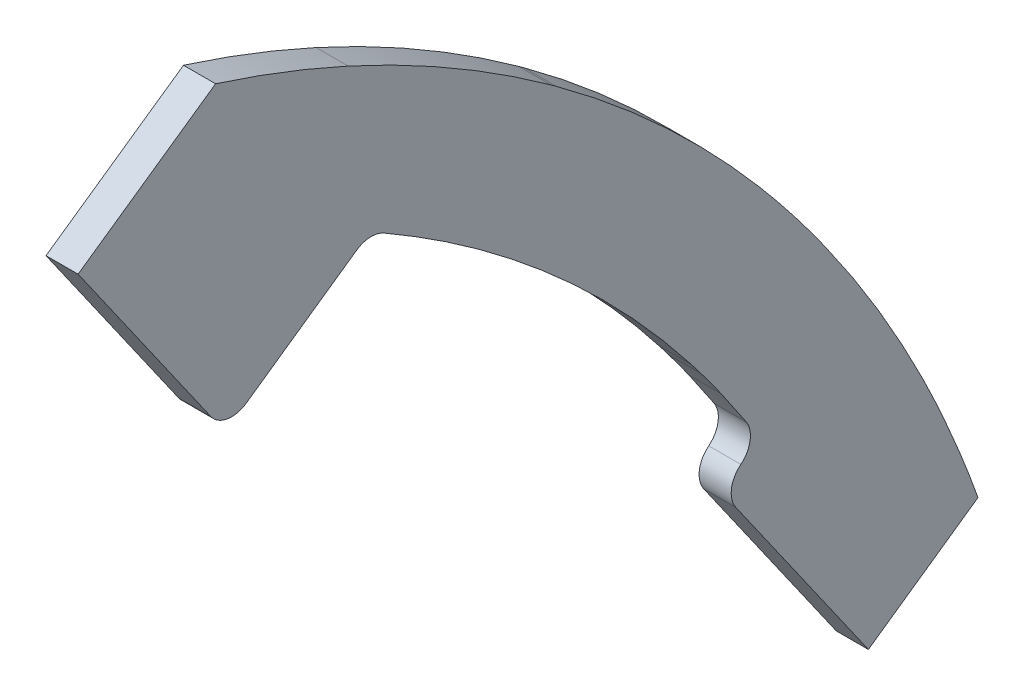
ISO-10303-21;
HEADER;
FILE_DESCRIPTION(('STEP AP214'),'2;1');
FILE_NAME('part.step','',(''),(''),'','','');
FILE_SCHEMA(('AUTOMOTIVE_DESIGN { 1 0 10303 214 1 1 1 1 }'));
ENDSEC;
DATA;
#1=APPLICATION_CONTEXT('core data for automotive mechanical design processes');
#2=APPLICATION_PROTOCOL_DEFINITION('international standard','automotive_design',2000,#1);
#3=PRODUCT_CONTEXT('',#1,'mechanical');
#4=PRODUCT('Part','Part','',(#3));
#5=PRODUCT_RELATED_PRODUCT_CATEGORY('part','',(#4));
#6=PRODUCT_DEFINITION_FORMATION('','',#4);
#7=PRODUCT_DEFINITION_CONTEXT('part definition',#1,'design');
#8=PRODUCT_DEFINITION('design','',#6,#7);
#9=PRODUCT_DEFINITION_SHAPE('','',#8);
#10=(LENGTH_UNIT() NAMED_UNIT(*) SI_UNIT(.MILLI.,.METRE.));
#11=(NAMED_UNIT(*) PLANE_ANGLE_UNIT() SI_UNIT($,.RADIAN.));
#12=(NAMED_UNIT(*) SI_UNIT($,.STERADIAN.) SOLID_ANGLE_UNIT());
#13=UNCERTAINTY_MEASURE_WITH_UNIT(LENGTH_MEASURE(1.E-05),#10,'distance_accuracy_value','');
#14=(GEOMETRIC_REPRESENTATION_CONTEXT(3) GLOBAL_UNCERTAINTY_ASSIGNED_CONTEXT((#13)) GLOBAL_UNIT_ASSIGNED_CONTEXT((#10,
#11,#12)) REPRESENTATION_CONTEXT('',''));
#15=CARTESIAN_POINT('',(0.,0.,0.));
#16=DIRECTION('',(0.,0.,1.));
#17=DIRECTION('',(1.,0.,0.));
#18=AXIS2_PLACEMENT_3D('',#15,#16,#17);
#19=CARTESIAN_POINT('',(-1.5875,79.185436309453,-95.7912382765299));
#20=CARTESIAN_POINT('',(-1.5875,85.5615552261648,-92.9425869088173));
#21=CARTESIAN_POINT('',(-1.5875,91.6478017593914,-89.4641241758632));
#22=CARTESIAN_POINT('',(-1.5875,97.3383774812052,-85.4160257219503));
#23=B_SPLINE_CURVE_WITH_KNOTS('',3,(#19,#20,#21,#22),.UNSPECIFIED.,.F.,.F.,(4,4),(0.,1.),.UNSPECIFIED.);
#24=DIRECTION('',(1.,0.,0.));
#25=VECTOR('',#24,1.);
#26=SURFACE_OF_LINEAR_EXTRUSION('',#23,#25);
#27=CARTESIAN_POINT('',(-1.5875,97.3383774812052,-85.4160257219503));
#28=CARTESIAN_POINT('',(-1.5875,96.1185054495558,-86.2838047177313));
#29=CARTESIAN_POINT('',(-1.5875,94.8804510622425,-87.1254071066499));
#30=CARTESIAN_POINT('',(-1.5875,93.6252565249009,-87.9402401067826));
#31=B_SPLINE_CURVE_WITH_KNOTS('',3,(#27,#28,#29,#30),.UNSPECIFIED.,.F.,.F.,(4,4),
(0.785632932187644,1.),.UNSPECIFIED.);
#32=CARTESIAN_POINT('',(-1.5875,93.625282671798,-87.9402803842903));
#33=VERTEX_POINT('',#32);
#34=CARTESIAN_POINT('',(-1.5875,97.3383774204889,-85.416025636599));
#35=VERTEX_POINT('',#34);
#36=EDGE_CURVE('E383',#33,#35,#31,.F.);
#37=ORIENTED_EDGE('',*,*,#36,.F.);
#38=DIRECTION('',(1.,0.,0.));
#39=VECTOR('',#38,1.);
#40=CARTESIAN_POINT('',(-1.5875,93.6252565239648,-87.9402401073903));
#41=LINE('',#40,#39);
#42=CARTESIAN_POINT('',(1.5875,93.625282671798,-87.9402803842903));
#43=VERTEX_POINT('',#42);
#44=EDGE_CURVE('E64',#33,#43,#41,.T.);
#45=ORIENTED_EDGE('',*,*,#44,.T.);
#46=CARTESIAN_POINT('',(1.5875,93.6252565244328,-87.9402401070865));
#47=CARTESIAN_POINT('',(1.5875,94.8804510619347,-87.1254071068591));
#48=CARTESIAN_POINT('',(1.5875,96.1185054494041,-86.2838047178392));
#49=CARTESIAN_POINT('',(1.5875,97.3383774812052,-85.4160257219503));
#50=B_SPLINE_CURVE_WITH_KNOTS('',3,(#46,#47,#48,#49),.UNSPECIFIED.,.F.,.F.,(4,4),
(0.785632932160998,1.),.UNSPECIFIED.);
#51=CARTESIAN_POINT('',(1.5875,97.3383774204889,-85.416025636599));
#52=VERTEX_POINT('',#51);
#53=EDGE_CURVE('E287',#43,#52,#50,.T.);
#54=ORIENTED_EDGE('',*,*,#53,.T.);
#55=DIRECTION('',(1.,0.,0.));
#56=VECTOR('',#55,1.);
#57=CARTESIAN_POINT('',(-1.5875,97.3383774204889,-85.416025636599));
#58=LINE('',#57,#56);
#59=EDGE_CURVE('E374',#35,#52,#58,.T.);
#60=ORIENTED_EDGE('',*,*,#59,.F.);
#61=EDGE_LOOP('',(#37,#45,#54,#60));
#62=FACE_BOUND('',#61,.T.);
#63=ADVANCED_FACE('F41',(#62),#26,.F.);
#64=CARTESIAN_POINT('',(1.5875,84.3658917657913,-107.386620170409));
#65=CARTESIAN_POINT('',(1.5875,79.0286884505717,-109.77111636803));
#66=CARTESIAN_POINT('',(1.5875,73.5144507800528,-111.759937992686));
#67=CARTESIAN_POINT('',(1.5875,67.8835058486477,-113.331446437734));
#68=(BOUNDED_CURVE() B_SPLINE_CURVE(3,(#64,#65,#66,#67),.UNSPECIFIED.,.F.,
.F.) B_SPLINE_CURVE_WITH_KNOTS((4,4),(0.,1.),
.UNSPECIFIED.) CURVE() GEOMETRIC_REPRESENTATION_ITEM() RATIONAL_B_SPLINE_CURVE((1.,1.,1.,1.)) REPRESENTATION_ITEM(''));
#69=DIRECTION('',(-1.,0.,0.));
#70=VECTOR('',#69,1.);
#71=SURFACE_OF_LINEAR_EXTRUSION('',#68,#70);
#72=DIRECTION('',(1.,0.,0.));
#73=VECTOR('',#72,1.);
#74=CARTESIAN_POINT('',(-2.2225,75.6870130191699,-110.85997856764));
#75=LINE('',#74,#73);
#76=CARTESIAN_POINT('',(-1.5875,75.6870130191699,-110.85997856764));
#77=VERTEX_POINT('',#76);
#78=CARTESIAN_POINT('',(1.5875,75.6870130191699,-110.85997856764));
#79=VERTEX_POINT('',#78);
#80=EDGE_CURVE('E201',#77,#79,#75,.T.);
#81=ORIENTED_EDGE('',*,*,#80,.F.);
#82=CARTESIAN_POINT('',(-1.5875,84.3658917657913,-107.386620170409));
#83=CARTESIAN_POINT('',(-1.5875,79.0286884505717,-109.77111636803));
#84=CARTESIAN_POINT('',(-1.5875,73.5144507800528,-111.759937992686));
#85=CARTESIAN_POINT('',(-1.5875,67.8835058486477,-113.331446437734));
#86=(BOUNDED_CURVE() B_SPLINE_CURVE(3,(#82,#83,#84,#85),.UNSPECIFIED.,.F.,
.F.) B_SPLINE_CURVE_WITH_KNOTS((4,4),(0.,1.),
.UNSPECIFIED.) CURVE() GEOMETRIC_REPRESENTATION_ITEM() RATIONAL_B_SPLINE_CURVE((1.,1.,1.,1.)) REPRESENTATION_ITEM(''));
#87=CARTESIAN_POINT('',(-1.5875,84.3658917657913,-107.386620170409));
#88=VERTEX_POINT('',#87);
#89=EDGE_CURVE('E478',#88,#77,#86,.T.);
#90=ORIENTED_EDGE('',*,*,#89,.F.);
#91=DIRECTION('',(-1.,0.,0.));
#92=VECTOR('',#91,1.);
#93=CARTESIAN_POINT('',(1.5875,84.3658917657913,-107.386620170409));
#94=LINE('',#93,#92);
#95=CARTESIAN_POINT('',(1.5875,84.3658917657913,-107.386620170409));
#96=VERTEX_POINT('',#95);
#97=EDGE_CURVE('E220',#96,#88,#94,.T.);
#98=ORIENTED_EDGE('',*,*,#97,.F.);
#99=EDGE_CURVE('E448',#96,#79,#68,.T.);
#100=ORIENTED_EDGE('',*,*,#99,.T.);
#101=EDGE_LOOP('',(#81,#90,#98,#100));
#102=FACE_BOUND('',#101,.T.);
#103=ADVANCED_FACE('F310',(#102),#71,.T.);
#104=CARTESIAN_POINT('',(1.5875,104.700101100998,-95.7646983588532));
#105=CARTESIAN_POINT('',(1.5875,98.3283858568585,-100.29733826903));
#106=CARTESIAN_POINT('',(1.5875,91.5059052747289,-104.196684492764));
#107=CARTESIAN_POINT('',(1.5875,84.3658917657913,-107.386620170409));
#108=(BOUNDED_CURVE() B_SPLINE_CURVE(3,(#104,#105,#106,#107),.UNSPECIFIED.,.F.,
.F.) B_SPLINE_CURVE_WITH_KNOTS((4,4),(0.000350040646092085,1.),
.UNSPECIFIED.) CURVE() GEOMETRIC_REPRESENTATION_ITEM() RATIONAL_B_SPLINE_CURVE((1.,1.,1.,1.)) REPRESENTATION_ITEM(''));
#109=DIRECTION('',(-1.,0.,0.));
#110=VECTOR('',#109,1.);
#111=SURFACE_OF_LINEAR_EXTRUSION('',#108,#110);
#112=CARTESIAN_POINT('',(-1.5875,104.700101100998,-95.7646983588532));
#113=CARTESIAN_POINT('',(-1.5875,98.3283858568585,-100.29733826903));
#114=CARTESIAN_POINT('',(-1.5875,91.5059052747289,-104.196684492764));
#115=CARTESIAN_POINT('',(-1.5875,84.3658917657913,-107.386620170409));
#116=(BOUNDED_CURVE() B_SPLINE_CURVE(3,(#112,#113,#114,#115),.UNSPECIFIED.,.F.,
.F.) B_SPLINE_CURVE_WITH_KNOTS((4,4),(0.000350040646092085,1.),
.UNSPECIFIED.) CURVE() GEOMETRIC_REPRESENTATION_ITEM() RATIONAL_B_SPLINE_CURVE((1.,1.,1.,1.)) REPRESENTATION_ITEM(''));
#117=CARTESIAN_POINT('',(-1.5875,104.700100970802,-95.7646981758488));
#118=VERTEX_POINT('',#117);
#119=EDGE_CURVE('E474',#118,#88,#116,.T.);
#120=ORIENTED_EDGE('',*,*,#119,.F.);
#121=DIRECTION('',(-1.,0.,0.));
#122=VECTOR('',#121,1.);
#123=CARTESIAN_POINT('',(1.5875,104.700100970802,-95.7646981758488));
#124=LINE('',#123,#122);
#125=CARTESIAN_POINT('',(1.5875,104.700100970802,-95.7646981758488));
#126=VERTEX_POINT('',#125);
#127=EDGE_CURVE('E402',#126,#118,#124,.T.);
#128=ORIENTED_EDGE('',*,*,#127,.F.);
#129=EDGE_CURVE('E444',#126,#96,#108,.T.);
#130=ORIENTED_EDGE('',*,*,#129,.T.);
#131=ORIENTED_EDGE('',*,*,#97,.T.);
#132=EDGE_LOOP('',(#120,#128,#130,#131));
#133=FACE_BOUND('',#132,.T.);
#134=ADVANCED_FACE('F602',(#133),#111,.T.);
#135=CARTESIAN_POINT('',(1.5875,24.4998519396042,16.9760355825652));
#136=DIRECTION('',(-1.,0.,0.));
#137=DIRECTION('',(0.,0.,1.));
#138=AXIS2_PLACEMENT_3D('',#135,#136,#137);
#139=CYLINDRICAL_SURFACE('',#138,138.356615284748);
#140=CARTESIAN_POINT('',(-1.5875,24.4998519396042,16.9760355825652));
#141=DIRECTION('',(1.,0.,0.));
#142=DIRECTION('',(0.,0.,-1.));
#143=AXIS2_PLACEMENT_3D('',#140,#141,#142);
#144=CIRCLE('',#143,138.356615284748);
#145=CARTESIAN_POINT('',(-1.5875,107.663329549967,-93.5969673829078));
#146=VERTEX_POINT('',#145);
#147=EDGE_CURVE('E470',#146,#118,#144,.F.);
#148=ORIENTED_EDGE('',*,*,#147,.F.);
#149=DIRECTION('',(-1.,0.,0.));
#150=VECTOR('',#149,1.);
#151=CARTESIAN_POINT('',(1.5875,107.663329549967,-93.5969673829078));
#152=LINE('',#151,#150);
#153=CARTESIAN_POINT('',(1.5875,107.663329549967,-93.5969673829078));
#154=VERTEX_POINT('',#153);
#155=EDGE_CURVE('E405',#154,#146,#152,.T.);
#156=ORIENTED_EDGE('',*,*,#155,.F.);
#157=CARTESIAN_POINT('',(1.5875,24.4998519396042,16.9760355825652));
#158=DIRECTION('',(1.,0.,0.));
#159=DIRECTION('',(0.,0.,-1.));
#160=AXIS2_PLACEMENT_3D('',#157,#158,#159);
#161=CIRCLE('',#160,138.356615284748);
#162=EDGE_CURVE('E440',#154,#126,#161,.F.);
#163=ORIENTED_EDGE('',*,*,#162,.T.);
#164=ORIENTED_EDGE('',*,*,#127,.T.);
#165=EDGE_LOOP('',(#148,#156,#163,#164));
#166=FACE_BOUND('',#165,.T.);
#167=ADVANCED_FACE('F605',(#166),#139,.T.);
#168=CARTESIAN_POINT('',(1.5875,37.7943846700121,-0.700190199036881));
#169=DIRECTION('',(-1.,0.,0.));
#170=DIRECTION('',(0.,0.,1.));
#171=AXIS2_PLACEMENT_3D('',#168,#169,#170);
#172=CYLINDRICAL_SURFACE('',#171,116.238894853704);
#173=CARTESIAN_POINT('',(-1.5875,37.7943846700121,-0.700190199036881));
#174=DIRECTION('',(1.,0.,0.));
#175=DIRECTION('',(0.,0.,-1.));
#176=AXIS2_PLACEMENT_3D('',#173,#174,#175);
#177=CIRCLE('',#176,116.238894853704);
#178=CARTESIAN_POINT('',(-1.5875,109.04382947504,-92.542431525051));
#179=VERTEX_POINT('',#178);
#180=EDGE_CURVE('E466',#179,#146,#177,.F.);
#181=ORIENTED_EDGE('',*,*,#180,.F.);
#182=DIRECTION('',(-1.,0.,0.));
#183=VECTOR('',#182,1.);
#184=CARTESIAN_POINT('',(1.5875,109.04382947504,-92.542431525051));
#185=LINE('',#184,#183);
#186=CARTESIAN_POINT('',(1.5875,109.04382947504,-92.542431525051));
#187=VERTEX_POINT('',#186);
#188=EDGE_CURVE('E408',#187,#179,#185,.T.);
#189=ORIENTED_EDGE('',*,*,#188,.F.);
#190=CARTESIAN_POINT('',(1.5875,37.7943846700121,-0.700190199036881));
#191=DIRECTION('',(1.,0.,0.));
#192=DIRECTION('',(0.,0.,-1.));
#193=AXIS2_PLACEMENT_3D('',#190,#191,#192);
#194=CIRCLE('',#193,116.238894853704);
#195=EDGE_CURVE('E436',#187,#154,#194,.F.);
#196=ORIENTED_EDGE('',*,*,#195,.T.);
#197=ORIENTED_EDGE('',*,*,#155,.T.);
#198=EDGE_LOOP('',(#181,#189,#196,#197));
#199=FACE_BOUND('',#198,.T.);
#200=ADVANCED_FACE('F583',(#199),#172,.T.);
#201=CARTESIAN_POINT('',(1.5875,131.762387795402,-69.1601607680626));
#202=CARTESIAN_POINT('',(1.5875,125.3273907522,-77.9653795791454));
#203=CARTESIAN_POINT('',(1.5875,117.655754062412,-85.8610729670904));
#204=CARTESIAN_POINT('',(1.5875,109.043829631221,-92.5424317263725));
#205=(BOUNDED_CURVE() B_SPLINE_CURVE(3,(#201,#202,#203,#204),.UNSPECIFIED.,.F.,
.F.) B_SPLINE_CURVE_WITH_KNOTS((4,4),(0.00371163390610156,1.),
.UNSPECIFIED.) CURVE() GEOMETRIC_REPRESENTATION_ITEM() RATIONAL_B_SPLINE_CURVE((1.,1.,1.,1.)) REPRESENTATION_ITEM(''));
#206=DIRECTION('',(-1.,0.,0.));
#207=VECTOR('',#206,1.);
#208=SURFACE_OF_LINEAR_EXTRUSION('',#205,#207);
#209=CARTESIAN_POINT('',(-1.5875,131.762387795402,-69.1601607680626));
#210=CARTESIAN_POINT('',(-1.5875,125.3273907522,-77.9653795791454));
#211=CARTESIAN_POINT('',(-1.5875,117.655754062412,-85.8610729670904));
#212=CARTESIAN_POINT('',(-1.5875,109.043829631221,-92.5424317263725));
#213=(BOUNDED_CURVE() B_SPLINE_CURVE(3,(#209,#210,#211,#212),.UNSPECIFIED.,.F.,
.F.) B_SPLINE_CURVE_WITH_KNOTS((4,4),(0.00371163390610156,1.),
.UNSPECIFIED.) CURVE() GEOMETRIC_REPRESENTATION_ITEM() RATIONAL_B_SPLINE_CURVE((1.,1.,1.,1.)) REPRESENTATION_ITEM(''));
#214=CARTESIAN_POINT('',(-1.5875,131.762387850463,-69.1601608083021));
#215=VERTEX_POINT('',#214);
#216=EDGE_CURVE('E462',#215,#179,#213,.T.);
#217=ORIENTED_EDGE('',*,*,#216,.F.);
#218=DIRECTION('',(-1.,0.,0.));
#219=VECTOR('',#218,1.);
#220=CARTESIAN_POINT('',(1.5875,131.762387850463,-69.1601608083021));
#221=LINE('',#220,#219);
#222=CARTESIAN_POINT('',(1.5875,131.762387850463,-69.1601608083021));
#223=VERTEX_POINT('',#222);
#224=EDGE_CURVE('E411',#223,#215,#221,.T.);
#225=ORIENTED_EDGE('',*,*,#224,.F.);
#226=EDGE_CURVE('E432',#223,#187,#205,.T.);
#227=ORIENTED_EDGE('',*,*,#226,.T.);
#228=ORIENTED_EDGE('',*,*,#188,.T.);
#229=EDGE_LOOP('',(#217,#225,#227,#228));
#230=FACE_BOUND('',#229,.T.);
#231=ADVANCED_FACE('F579',(#230),#208,.T.);
#232=CARTESIAN_POINT('',(1.5875,38.1315219644397,-0.733201972180109));
#233=DIRECTION('',(-1.,0.,0.));
#234=DIRECTION('',(0.,0.,1.));
#235=AXIS2_PLACEMENT_3D('',#232,#233,#234);
#236=CYLINDRICAL_SURFACE('',#235,115.969770811737);
#237=CARTESIAN_POINT('',(-1.5875,38.1315219644397,-0.733201972180109));
#238=DIRECTION('',(1.,0.,0.));
#239=DIRECTION('',(0.,0.,-1.));
#240=AXIS2_PLACEMENT_3D('',#237,#238,#239);
#241=CIRCLE('',#240,115.969770811737);
#242=CARTESIAN_POINT('',(-1.5875,132.163918603122,-68.6073216682205));
#243=VERTEX_POINT('',#242);
#244=EDGE_CURVE('E458',#243,#215,#241,.F.);
#245=ORIENTED_EDGE('',*,*,#244,.F.);
#246=DIRECTION('',(-1.,0.,0.));
#247=VECTOR('',#246,1.);
#248=CARTESIAN_POINT('',(1.5875,132.163918603122,-68.6073216682205));
#249=LINE('',#248,#247);
#250=CARTESIAN_POINT('',(1.5875,132.163918603122,-68.6073216682205));
#251=VERTEX_POINT('',#250);
#252=EDGE_CURVE('E414',#251,#243,#249,.T.);
#253=ORIENTED_EDGE('',*,*,#252,.F.);
#254=CARTESIAN_POINT('',(1.5875,38.1315219644397,-0.733201972180109));
#255=DIRECTION('',(1.,0.,0.));
#256=DIRECTION('',(0.,0.,-1.));
#257=AXIS2_PLACEMENT_3D('',#254,#255,#256);
#258=CIRCLE('',#257,115.969770811737);
#259=EDGE_CURVE('E428',#251,#223,#258,.F.);
#260=ORIENTED_EDGE('',*,*,#259,.T.);
#261=ORIENTED_EDGE('',*,*,#224,.T.);
#262=EDGE_LOOP('',(#245,#253,#260,#261));
#263=FACE_BOUND('',#262,.T.);
#264=ADVANCED_FACE('F575',(#263),#236,.T.);
#265=CARTESIAN_POINT('',(1.5875,143.805018298944,-48.5587522739416));
#266=CARTESIAN_POINT('',(1.5875,140.599419675986,-55.6053209780211));
#267=CARTESIAN_POINT('',(1.5875,136.693557168257,-62.3320184659315));
#268=CARTESIAN_POINT('',(1.5875,132.163918658419,-68.6073217081349));
#269=(BOUNDED_CURVE() B_SPLINE_CURVE(3,(#265,#266,#267,#268),.UNSPECIFIED.,.F.,
.F.) B_SPLINE_CURVE_WITH_KNOTS((4,4),(0.,1.),
.UNSPECIFIED.) CURVE() GEOMETRIC_REPRESENTATION_ITEM() RATIONAL_B_SPLINE_CURVE((1.,1.,1.,1.)) REPRESENTATION_ITEM(''));
#270=DIRECTION('',(-1.,0.,0.));
#271=VECTOR('',#270,1.);
#272=SURFACE_OF_LINEAR_EXTRUSION('',#269,#271);
#273=CARTESIAN_POINT('',(-1.5875,143.805018298944,-48.5587522739416));
#274=CARTESIAN_POINT('',(-1.5875,140.599419675986,-55.6053209780211));
#275=CARTESIAN_POINT('',(-1.5875,136.693557168257,-62.3320184659315));
#276=CARTESIAN_POINT('',(-1.5875,132.163918658419,-68.6073217081349));
#277=(BOUNDED_CURVE() B_SPLINE_CURVE(3,(#273,#274,#275,#276),.UNSPECIFIED.,.F.,
.F.) B_SPLINE_CURVE_WITH_KNOTS((4,4),(0.,1.),
.UNSPECIFIED.) CURVE() GEOMETRIC_REPRESENTATION_ITEM() RATIONAL_B_SPLINE_CURVE((1.,1.,1.,1.)) REPRESENTATION_ITEM(''));
#278=CARTESIAN_POINT('',(-1.5875,143.805018298944,-48.5587522739416));
#279=VERTEX_POINT('',#278);
#280=EDGE_CURVE('E454',#279,#243,#277,.T.);
#281=ORIENTED_EDGE('',*,*,#280,.F.);
#282=DIRECTION('',(-1.,0.,0.));
#283=VECTOR('',#282,1.);
#284=CARTESIAN_POINT('',(1.5875,143.805018298944,-48.5587522739416));
#285=LINE('',#284,#283);
#286=CARTESIAN_POINT('',(1.5875,143.805018298944,-48.5587522739416));
#287=VERTEX_POINT('',#286);
#288=EDGE_CURVE('E417',#287,#279,#285,.T.);
#289=ORIENTED_EDGE('',*,*,#288,.F.);
#290=EDGE_CURVE('E424',#287,#251,#269,.T.);
#291=ORIENTED_EDGE('',*,*,#290,.T.);
#292=ORIENTED_EDGE('',*,*,#252,.T.);
#293=EDGE_LOOP('',(#281,#289,#291,#292));
#294=FACE_BOUND('',#293,.T.);
#295=ADVANCED_FACE('F569',(#294),#272,.T.);
#296=CARTESIAN_POINT('',(1.5875,154.329134724805,-4.73473554458258E-09));
#297=CARTESIAN_POINT('',(1.5875,154.329158003076,-12.5176344556076));
#298=CARTESIAN_POINT('',(1.5875,152.548147786039,-25.0362555036744));
#299=CARTESIAN_POINT('',(1.5875,148.986948090842,-37.1677991715786));
#300=CARTESIAN_POINT('',(1.5875,143.805018298944,-48.5587522739416));
#301=(BOUNDED_CURVE() B_SPLINE_CURVE(4,(#296,#297,#298,#299,#300),.UNSPECIFIED.,.F.,
.F.) B_SPLINE_CURVE_WITH_KNOTS((5,5),(0.,1.),
.UNSPECIFIED.) CURVE() GEOMETRIC_REPRESENTATION_ITEM() RATIONAL_B_SPLINE_CURVE((1.,1.,1.,1.,1.)) REPRESENTATION_ITEM(''));
#302=DIRECTION('',(-1.,0.,0.));
#303=VECTOR('',#302,1.);
#304=SURFACE_OF_LINEAR_EXTRUSION('',#301,#303);
#305=DIRECTION('',(1.,0.,0.));
#306=VECTOR('',#305,1.);
#307=CARTESIAN_POINT('',(-2.2225,148.846872618275,-35.4411700044837));
#308=LINE('',#307,#306);
#309=CARTESIAN_POINT('',(-1.5875,148.846872618275,-35.4411700044837));
#310=VERTEX_POINT('',#309);
#311=CARTESIAN_POINT('',(1.5875,148.846872618275,-35.4411700044837));
#312=VERTEX_POINT('',#311);
#313=EDGE_CURVE('E528',#310,#312,#308,.T.);
#314=ORIENTED_EDGE('',*,*,#313,.T.);
#315=EDGE_CURVE('E421',#312,#287,#301,.T.);
#316=ORIENTED_EDGE('',*,*,#315,.T.);
#317=ORIENTED_EDGE('',*,*,#288,.T.);
#318=CARTESIAN_POINT('',(-1.5875,154.329134724805,-4.73473554458258E-09));
#319=CARTESIAN_POINT('',(-1.5875,154.329158003076,-12.5176344556076));
#320=CARTESIAN_POINT('',(-1.5875,152.548147786039,-25.0362555036744));
#321=CARTESIAN_POINT('',(-1.5875,148.986948090842,-37.1677991715786));
#322=CARTESIAN_POINT('',(-1.5875,143.805018298944,-48.5587522739416));
#323=(BOUNDED_CURVE() B_SPLINE_CURVE(4,(#318,#319,#320,#321,#322),.UNSPECIFIED.,.F.,
.F.) B_SPLINE_CURVE_WITH_KNOTS((5,5),(0.,1.),
.UNSPECIFIED.) CURVE() GEOMETRIC_REPRESENTATION_ITEM() RATIONAL_B_SPLINE_CURVE((1.,1.,1.,1.,1.)) REPRESENTATION_ITEM(''));
#324=EDGE_CURVE('E451',#310,#279,#323,.T.);
#325=ORIENTED_EDGE('',*,*,#324,.F.);
#326=EDGE_LOOP('',(#314,#316,#317,#325));
#327=FACE_BOUND('',#326,.T.);
#328=ADVANCED_FACE('F566',(#327),#304,.T.);
#329=CARTESIAN_POINT('',(1.5875,0.,0.));
#330=DIRECTION('',(1.,0.,0.));
#331=DIRECTION('',(0.,0.,-1.));
#332=AXIS2_PLACEMENT_3D('',#329,#330,#331);
#333=PLANE('',#332);
#334=ORIENTED_EDGE('',*,*,#53,.F.);
#335=CARTESIAN_POINT('',(1.5875,92.242231381924,-85.8097844151773));
#336=DIRECTION('',(1.,0.,0.));
#337=DIRECTION('',(0.,0.,-1.));
#338=AXIS2_PLACEMENT_3D('',#335,#336,#337);
#339=CIRCLE('',#338,2.54);
#340=CARTESIAN_POINT('',(1.5875,90.2597892443039,-87.3977148831097));
#341=VERTEX_POINT('',#340);
#342=EDGE_CURVE('E11',#43,#341,#339,.F.);
#343=ORIENTED_EDGE('',*,*,#342,.T.);
#344=CARTESIAN_POINT('',(1.5875,88.2773471066838,-88.9856453510422));
#345=DIRECTION('',(1.,0.,0.));
#346=DIRECTION('',(0.,0.,-1.));
#347=AXIS2_PLACEMENT_3D('',#344,#345,#346);
#348=CIRCLE('',#347,2.54);
#349=CARTESIAN_POINT('',(1.5875,86.8204629583522,-86.9049991585482));
#350=VERTEX_POINT('',#349);
#351=EDGE_CURVE('E224',#341,#350,#348,.T.);
#352=ORIENTED_EDGE('',*,*,#351,.T.);
#353=DIRECTION('',(0.,0.819152044288992,0.573576436351046));
#354=VECTOR('',#353,1.);
#355=CARTESIAN_POINT('',(1.5875,69.3950510962145,-99.1064039008259));
#356=LINE('',#355,#354);
#357=CARTESIAN_POINT('',(1.5875,68.0943383024581,-100.017187203005));
#358=VERTEX_POINT('',#357);
#359=EDGE_CURVE('E214',#358,#350,#356,.T.);
#360=ORIENTED_EDGE('',*,*,#359,.F.);
#361=DIRECTION('',(0.,-0.573576436351047,0.819152044288991));
#362=VECTOR('',#361,1.);
#363=CARTESIAN_POINT('',(1.5875,-1.30040387030879,-0.910552592707298));
#364=LINE('',#363,#362);
#365=EDGE_CURVE('E195',#79,#358,#364,.T.);
#366=ORIENTED_EDGE('',*,*,#365,.F.);
#367=ORIENTED_EDGE('',*,*,#99,.F.);
#368=ORIENTED_EDGE('',*,*,#129,.F.);
#369=ORIENTED_EDGE('',*,*,#162,.F.);
#370=ORIENTED_EDGE('',*,*,#195,.F.);
#371=ORIENTED_EDGE('',*,*,#226,.F.);
#372=ORIENTED_EDGE('',*,*,#259,.F.);
#373=ORIENTED_EDGE('',*,*,#290,.F.);
#374=ORIENTED_EDGE('',*,*,#315,.F.);
#375=DIRECTION('',(0.,0.573576436351047,-0.819152044288991));
#376=VECTOR('',#375,1.);
#377=CARTESIAN_POINT('',(1.5875,83.2258476997615,58.2753659332664));
#378=LINE('',#377,#376);
#379=CARTESIAN_POINT('',(1.5875,139.337623160252,-21.8416316940261));
#380=VERTEX_POINT('',#379);
#381=EDGE_CURVE('E207',#380,#312,#378,.T.);
#382=ORIENTED_EDGE('',*,*,#381,.F.);
#383=DIRECTION('',(0.,-0.819152044288991,-0.573576436351046));
#384=VECTOR('',#383,1.);
#385=CARTESIAN_POINT('',(1.5875,56.0978619456923,-80.1160497202346));
#386=LINE('',#385,#384);
#387=CARTESIAN_POINT('',(1.5875,120.597893913008,-34.9526411219532));
#388=VERTEX_POINT('',#387);
#389=EDGE_CURVE('E245',#380,#388,#386,.T.);
#390=ORIENTED_EDGE('',*,*,#389,.T.);
#391=CARTESIAN_POINT('',(1.5875,122.054778061339,-37.0332873144472));
#392=DIRECTION('',(1.,0.,0.));
#393=DIRECTION('',(0.,0.,-1.));
#394=AXIS2_PLACEMENT_3D('',#391,#392,#393);
#395=CIRCLE('',#394,2.54);
#396=CARTESIAN_POINT('',(1.5875,119.974131868845,-38.4901714627789));
#397=VERTEX_POINT('',#396);
#398=EDGE_CURVE('E395',#388,#397,#395,.T.);
#399=ORIENTED_EDGE('',*,*,#398,.T.);
#400=DIRECTION('',(0.,0.573576436351048,-0.81915204428899));
#401=VECTOR('',#400,1.);
#402=CARTESIAN_POINT('',(1.5875,62.419385774821,43.7065244499498));
#403=LINE('',#402,#401);
#404=CARTESIAN_POINT('',(1.5875,127.601705916483,-49.3834761351907));
#405=VERTEX_POINT('',#404);
#406=EDGE_CURVE('E228',#397,#405,#403,.T.);
#407=ORIENTED_EDGE('',*,*,#406,.T.);
#408=CARTESIAN_POINT('',(1.5875,125.521059723989,-50.8403602835224));
#409=DIRECTION('',(1.,0.,0.));
#410=DIRECTION('',(0.,0.,-1.));
#411=AXIS2_PLACEMENT_3D('',#408,#409,#410);
#412=CIRCLE('',#411,2.54);
#413=CARTESIAN_POINT('',(1.5875,127.723086053563,-52.1063350069998));
#414=VERTEX_POINT('',#413);
#415=EDGE_CURVE('E273',#405,#414,#412,.F.);
#416=ORIENTED_EDGE('',*,*,#415,.T.);
#417=CARTESIAN_POINT('',(1.5875,121.866326193195,-61.1743149531148));
#418=CARTESIAN_POINT('',(1.5875,123.974053144219,-58.2542970000903));
#419=CARTESIAN_POINT('',(1.5875,125.929146981796,-55.2266935879119));
#420=CARTESIAN_POINT('',(1.5875,127.723084013098,-52.1063338338675));
#421=B_SPLINE_CURVE_WITH_KNOTS('',3,(#417,#418,#419,#420),.UNSPECIFIED.,.F.,.F.,(4,4),(0.,
0.521654973375704),.UNSPECIFIED.);
#422=CARTESIAN_POINT('',(1.5875,121.866326193195,-61.1743149531148));
#423=VERTEX_POINT('',#422);
#424=EDGE_CURVE('E512',#423,#414,#421,.T.);
#425=ORIENTED_EDGE('',*,*,#424,.F.);
#426=CARTESIAN_POINT('',(1.5875,38.1315219644397,-0.733201972180109));
#427=DIRECTION('',(1.,0.,0.));
#428=DIRECTION('',(0.,0.,-1.));
#429=AXIS2_PLACEMENT_3D('',#426,#427,#428);
#430=CIRCLE('',#429,103.269770811756);
#431=CARTESIAN_POINT('',(1.5875,121.508750299682,-61.6666358048924));
#432=VERTEX_POINT('',#431);
#433=EDGE_CURVE('E515',#432,#423,#430,.T.);
#434=ORIENTED_EDGE('',*,*,#433,.F.);
#435=CARTESIAN_POINT('',(1.5875,101.265776291321,-82.5029113643695));
#436=CARTESIAN_POINT('',(1.5875,103.186021190737,-81.0128788592663));
#437=CARTESIAN_POINT('',(1.5875,105.05079500765,-79.4575300652785));
#438=CARTESIAN_POINT('',(1.5875,108.67055082655,-76.2175544178662));
#439=CARTESIAN_POINT('',(1.5875,110.424413808767,-74.533650690174));
#440=CARTESIAN_POINT('',(1.5875,113.80780766714,-71.0509182015214));
#441=CARTESIAN_POINT('',(1.5875,115.440857885236,-69.2483824169529));
#442=CARTESIAN_POINT('',(1.5875,118.573951802496,-65.5375878203615));
#443=CARTESIAN_POINT('',(1.5875,120.074629803632,-63.6289900904389));
#444=CARTESIAN_POINT('',(1.5875,121.508750244606,-61.6666357646416));
#445=B_SPLINE_CURVE_WITH_KNOTS('',3,(#435,#436,#437,#438,#439,#440,#441,#442,#443,#444),
.UNSPECIFIED.,.F.,.F.,(4,2,2,2,4),(0.,0.25,0.5,0.75,1.),.UNSPECIFIED.);
#446=CARTESIAN_POINT('',(1.5875,101.265776291321,-82.5029113643695));
#447=VERTEX_POINT('',#446);
#448=EDGE_CURVE('E369',#447,#432,#445,.T.);
#449=ORIENTED_EDGE('',*,*,#448,.F.);
#450=CARTESIAN_POINT('',(1.5875,37.7943846700121,-0.700190199036881));
#451=DIRECTION('',(1.,0.,0.));
#452=DIRECTION('',(0.,0.,-1.));
#453=AXIS2_PLACEMENT_3D('',#450,#451,#452);
#454=CIRCLE('',#453,103.5388948386);
#455=CARTESIAN_POINT('',(1.5875,100.029605913248,-83.4472746262491));
#456=VERTEX_POINT('',#455);
#457=EDGE_CURVE('E360',#456,#447,#454,.T.);
#458=ORIENTED_EDGE('',*,*,#457,.F.);
#459=CARTESIAN_POINT('',(1.5875,24.4998519396042,16.9760355825652));
#460=DIRECTION('',(1.,0.,0.));
#461=DIRECTION('',(0.,0.,-1.));
#462=AXIS2_PLACEMENT_3D('',#459,#460,#461);
#463=CIRCLE('',#462,125.656615404596);
#464=EDGE_CURVE('E298',#52,#456,#463,.T.);
#465=ORIENTED_EDGE('',*,*,#464,.F.);
#466=EDGE_LOOP('',(#334,#343,#352,#360,#366,#367,#368,#369,#370,#371,#372,#373,#374,#382,#390,
#399,#407,#416,#425,#434,#449,#458,#465));
#467=FACE_BOUND('',#466,.T.);
#468=ADVANCED_FACE('F222',(#467),#333,.T.);
#469=CARTESIAN_POINT('',(-1.5875,0.,0.));
#470=DIRECTION('',(1.,0.,0.));
#471=DIRECTION('',(0.,0.,-1.));
#472=AXIS2_PLACEMENT_3D('',#469,#470,#471);
#473=PLANE('',#472);
#474=DIRECTION('',(0.,0.819152044288992,0.573576436351046));
#475=VECTOR('',#474,1.);
#476=CARTESIAN_POINT('',(-1.5875,69.3950510962145,-99.1064039008259));
#477=LINE('',#476,#475);
#478=CARTESIAN_POINT('',(-1.5875,68.094492764182,-100.017071848269));
#479=VERTEX_POINT('',#478);
#480=CARTESIAN_POINT('',(-1.5875,86.8204629583522,-86.9049991585482));
#481=VERTEX_POINT('',#480);
#482=EDGE_CURVE('E217',#479,#481,#477,.T.);
#483=ORIENTED_EDGE('',*,*,#482,.T.);
#484=CARTESIAN_POINT('',(-1.5875,88.2773471066838,-88.9856453510422));
#485=DIRECTION('',(1.,0.,0.));
#486=DIRECTION('',(0.,0.,-1.));
#487=AXIS2_PLACEMENT_3D('',#484,#485,#486);
#488=CIRCLE('',#487,2.54);
#489=CARTESIAN_POINT('',(-1.5875,90.2597892443039,-87.3977148831097));
#490=VERTEX_POINT('',#489);
#491=EDGE_CURVE('E251',#481,#490,#488,.F.);
#492=ORIENTED_EDGE('',*,*,#491,.T.);
#493=CARTESIAN_POINT('',(-1.5875,92.242231381924,-85.8097844151773));
#494=DIRECTION('',(1.,0.,0.));
#495=DIRECTION('',(0.,0.,-1.));
#496=AXIS2_PLACEMENT_3D('',#493,#494,#495);
#497=CIRCLE('',#496,2.54);
#498=EDGE_CURVE('E51',#490,#33,#497,.T.);
#499=ORIENTED_EDGE('',*,*,#498,.T.);
#500=ORIENTED_EDGE('',*,*,#36,.T.);
#501=CARTESIAN_POINT('',(-1.5875,24.4998519396042,16.9760355825652));
#502=DIRECTION('',(1.,0.,0.));
#503=DIRECTION('',(0.,0.,-1.));
#504=AXIS2_PLACEMENT_3D('',#501,#502,#503);
#505=CIRCLE('',#504,125.656615404596);
#506=CARTESIAN_POINT('',(-1.5875,100.029605913248,-83.4472746262491));
#507=VERTEX_POINT('',#506);
#508=EDGE_CURVE('E507',#35,#507,#505,.T.);
#509=ORIENTED_EDGE('',*,*,#508,.T.);
#510=CARTESIAN_POINT('',(-1.5875,37.7943846700121,-0.700190199036881));
#511=DIRECTION('',(1.,0.,0.));
#512=DIRECTION('',(0.,0.,-1.));
#513=AXIS2_PLACEMENT_3D('',#510,#511,#512);
#514=CIRCLE('',#513,103.5388948386);
#515=CARTESIAN_POINT('',(-1.5875,101.265776291321,-82.5029113643695));
#516=VERTEX_POINT('',#515);
#517=EDGE_CURVE('E504',#507,#516,#514,.T.);
#518=ORIENTED_EDGE('',*,*,#517,.T.);
#519=CARTESIAN_POINT('',(-1.5875,121.508750244606,-61.6666357646416));
#520=CARTESIAN_POINT('',(-1.5875,120.074629803632,-63.6289900904389));
#521=CARTESIAN_POINT('',(-1.5875,118.573951802496,-65.5375878203615));
#522=CARTESIAN_POINT('',(-1.5875,115.440857885236,-69.2483824169529));
#523=CARTESIAN_POINT('',(-1.5875,113.80780766714,-71.0509182015214));
#524=CARTESIAN_POINT('',(-1.5875,110.424413808767,-74.533650690174));
#525=CARTESIAN_POINT('',(-1.5875,108.67055082655,-76.2175544178662));
#526=CARTESIAN_POINT('',(-1.5875,105.05079500765,-79.4575300652785));
#527=CARTESIAN_POINT('',(-1.5875,103.186021190737,-81.0128788592663));
#528=CARTESIAN_POINT('',(-1.5875,101.265776291321,-82.5029113643695));
#529=B_SPLINE_CURVE_WITH_KNOTS('',3,(#519,#520,#521,#522,#523,#524,#525,#526,#527,#528),
.UNSPECIFIED.,.F.,.F.,(4,2,2,2,4),(0.,0.25,0.5,0.75,1.),.UNSPECIFIED.);
#530=CARTESIAN_POINT('',(-1.5875,121.508750299682,-61.6666358048924));
#531=VERTEX_POINT('',#530);
#532=EDGE_CURVE('E500',#516,#531,#529,.F.);
#533=ORIENTED_EDGE('',*,*,#532,.T.);
#534=CARTESIAN_POINT('',(-1.5875,38.1315219644397,-0.733201972180109));
#535=DIRECTION('',(1.,0.,0.));
#536=DIRECTION('',(0.,0.,-1.));
#537=AXIS2_PLACEMENT_3D('',#534,#535,#536);
#538=CIRCLE('',#537,103.269770811756);
#539=CARTESIAN_POINT('',(-1.5875,121.866326193195,-61.1743149531148));
#540=VERTEX_POINT('',#539);
#541=EDGE_CURVE('E497',#531,#540,#538,.T.);
#542=ORIENTED_EDGE('',*,*,#541,.T.);
#543=CARTESIAN_POINT('',(-1.5875,127.72308401308,-52.1063338338986));
#544=CARTESIAN_POINT('',(-1.5875,125.929146981783,-55.226693587932));
#545=CARTESIAN_POINT('',(-1.5875,123.974053144212,-58.2542970001));
#546=CARTESIAN_POINT('',(-1.5875,121.866326193195,-61.1743149531148));
#547=B_SPLINE_CURVE_WITH_KNOTS('',3,(#543,#544,#545,#546),.UNSPECIFIED.,.F.,.F.,(4,4),(0.,
0.521654973373969),.UNSPECIFIED.);
#548=CARTESIAN_POINT('',(-1.5875,127.723086053563,-52.1063350069998));
#549=VERTEX_POINT('',#548);
#550=EDGE_CURVE('E494',#540,#549,#547,.F.);
#551=ORIENTED_EDGE('',*,*,#550,.T.);
#552=CARTESIAN_POINT('',(-1.5875,125.521059723989,-50.8403602835224));
#553=DIRECTION('',(1.,0.,0.));
#554=DIRECTION('',(0.,0.,-1.));
#555=AXIS2_PLACEMENT_3D('',#552,#553,#554);
#556=CIRCLE('',#555,2.54);
#557=CARTESIAN_POINT('',(-1.5875,127.601705916483,-49.3834761351907));
#558=VERTEX_POINT('',#557);
#559=EDGE_CURVE('E268',#549,#558,#556,.T.);
#560=ORIENTED_EDGE('',*,*,#559,.T.);
#561=DIRECTION('',(0.,0.573576436351048,-0.81915204428899));
#562=VECTOR('',#561,1.);
#563=CARTESIAN_POINT('',(-1.5875,62.419385774821,43.7065244499498));
#564=LINE('',#563,#562);
#565=CARTESIAN_POINT('',(-1.5875,119.974131868845,-38.4901714627789));
#566=VERTEX_POINT('',#565);
#567=EDGE_CURVE('E240',#566,#558,#564,.T.);
#568=ORIENTED_EDGE('',*,*,#567,.F.);
#569=CARTESIAN_POINT('',(-1.5875,122.054778061339,-37.0332873144472));
#570=DIRECTION('',(1.,0.,0.));
#571=DIRECTION('',(0.,0.,-1.));
#572=AXIS2_PLACEMENT_3D('',#569,#570,#571);
#573=CIRCLE('',#572,2.54);
#574=CARTESIAN_POINT('',(-1.5875,120.597893913008,-34.9526411219532));
#575=VERTEX_POINT('',#574);
#576=EDGE_CURVE('E248',#566,#575,#573,.F.);
#577=ORIENTED_EDGE('',*,*,#576,.T.);
#578=DIRECTION('',(0.,-0.819152044288991,-0.573576436351046));
#579=VECTOR('',#578,1.);
#580=CARTESIAN_POINT('',(-1.5875,56.0978619456923,-80.1160497202346));
#581=LINE('',#580,#579);
#582=CARTESIAN_POINT('',(-1.5875,139.330666402612,-21.841157741719));
#583=VERTEX_POINT('',#582);
#584=EDGE_CURVE('E208',#583,#575,#581,.T.);
#585=ORIENTED_EDGE('',*,*,#584,.F.);
#586=DIRECTION('',(0.,0.573576436351047,-0.819152044288991));
#587=VECTOR('',#586,1.);
#588=CARTESIAN_POINT('',(-1.5875,83.2258476997615,58.2753659332664));
#589=LINE('',#588,#587);
#590=EDGE_CURVE('E523',#583,#310,#589,.T.);
#591=ORIENTED_EDGE('',*,*,#590,.T.);
#592=ORIENTED_EDGE('',*,*,#324,.T.);
#593=ORIENTED_EDGE('',*,*,#280,.T.);
#594=ORIENTED_EDGE('',*,*,#244,.T.);
#595=ORIENTED_EDGE('',*,*,#216,.T.);
#596=ORIENTED_EDGE('',*,*,#180,.T.);
#597=ORIENTED_EDGE('',*,*,#147,.T.);
#598=ORIENTED_EDGE('',*,*,#119,.T.);
#599=ORIENTED_EDGE('',*,*,#89,.T.);
#600=DIRECTION('',(0.,-0.573576436351047,0.819152044288991));
#601=VECTOR('',#600,1.);
#602=CARTESIAN_POINT('',(-1.5875,-1.30040387030879,-0.910552592707298));
#603=LINE('',#602,#601);
#604=EDGE_CURVE('E526',#77,#479,#603,.T.);
#605=ORIENTED_EDGE('',*,*,#604,.T.);
#606=EDGE_LOOP('',(#483,#492,#499,#500,#509,#518,#533,#542,#551,#560,#568,#577,#585,#591,#592,
#593,#594,#595,#596,#597,#598,#599,#605));
#607=FACE_BOUND('',#606,.T.);
#608=ADVANCED_FACE('F571',(#607),#473,.F.);
#609=CARTESIAN_POINT('',(-1.5875,121.866326193195,-61.1743149531148));
#610=CARTESIAN_POINT('',(-1.5875,125.906787913294,-55.5767109771983));
#611=CARTESIAN_POINT('',(-1.5875,129.386354000419,-49.5837523311952));
#612=CARTESIAN_POINT('',(-1.5875,132.24497933226,-43.2999026764781));
#613=B_SPLINE_CURVE_WITH_KNOTS('',3,(#609,#610,#611,#612),.UNSPECIFIED.,.F.,.F.,(4,4),(0.,1.),.UNSPECIFIED.);
#614=DIRECTION('',(1.,0.,0.));
#615=VECTOR('',#614,1.);
#616=SURFACE_OF_LINEAR_EXTRUSION('',#613,#615);
#617=ORIENTED_EDGE('',*,*,#424,.T.);
#618=DIRECTION('',(1.,0.,0.));
#619=VECTOR('',#618,1.);
#620=CARTESIAN_POINT('',(1.5875,127.723084013115,-52.1063338338372));
#621=LINE('',#620,#619);
#622=EDGE_CURVE('E264',#414,#549,#621,.F.);
#623=ORIENTED_EDGE('',*,*,#622,.T.);
#624=ORIENTED_EDGE('',*,*,#550,.F.);
#625=DIRECTION('',(1.,0.,0.));
#626=VECTOR('',#625,1.);
#627=CARTESIAN_POINT('',(-1.5875,121.866326193195,-61.1743149531148));
#628=LINE('',#627,#626);
#629=EDGE_CURVE('E482',#540,#423,#628,.T.);
#630=ORIENTED_EDGE('',*,*,#629,.T.);
#631=EDGE_LOOP('',(#617,#623,#624,#630));
#632=FACE_BOUND('',#631,.T.);
#633=ADVANCED_FACE('F631',(#632),#616,.F.);
#634=CARTESIAN_POINT('',(-1.5875,38.1315219644397,-0.733201972180109));
#635=DIRECTION('',(1.,0.,0.));
#636=DIRECTION('',(0.,0.,-1.));
#637=AXIS2_PLACEMENT_3D('',#634,#635,#636);
#638=CYLINDRICAL_SURFACE('',#637,103.269770811756);
#639=ORIENTED_EDGE('',*,*,#433,.T.);
#640=ORIENTED_EDGE('',*,*,#629,.F.);
#641=ORIENTED_EDGE('',*,*,#541,.F.);
#642=DIRECTION('',(1.,0.,0.));
#643=VECTOR('',#642,1.);
#644=CARTESIAN_POINT('',(-1.5875,121.508750299682,-61.6666358048924));
#645=LINE('',#644,#643);
#646=EDGE_CURVE('E485',#531,#432,#645,.T.);
#647=ORIENTED_EDGE('',*,*,#646,.T.);
#648=EDGE_LOOP('',(#639,#640,#641,#647));
#649=FACE_BOUND('',#648,.T.);
#650=ADVANCED_FACE('F344',(#649),#638,.F.);
#651=CARTESIAN_POINT('',(-1.5875,101.265776291321,-82.5029113643695));
#652=CARTESIAN_POINT('',(-1.5875,103.186021190737,-81.0128788592663));
#653=CARTESIAN_POINT('',(-1.5875,105.05079500765,-79.4575300652785));
#654=CARTESIAN_POINT('',(-1.5875,108.67055082655,-76.2175544178662));
#655=CARTESIAN_POINT('',(-1.5875,110.424413808767,-74.533650690174));
#656=CARTESIAN_POINT('',(-1.5875,113.80780766714,-71.0509182015214));
#657=CARTESIAN_POINT('',(-1.5875,115.440857885236,-69.2483824169529));
#658=CARTESIAN_POINT('',(-1.5875,118.573951802496,-65.5375878203615));
#659=CARTESIAN_POINT('',(-1.5875,120.074629803632,-63.6289900904389));
#660=CARTESIAN_POINT('',(-1.5875,121.508750244606,-61.6666357646416));
#661=B_SPLINE_CURVE_WITH_KNOTS('',3,(#651,#652,#653,#654,#655,#656,#657,#658,#659,#660),
.UNSPECIFIED.,.F.,.F.,(4,2,2,2,4),(0.,0.25,0.5,0.75,1.),.UNSPECIFIED.);
#662=DIRECTION('',(1.,0.,0.));
#663=VECTOR('',#662,1.);
#664=SURFACE_OF_LINEAR_EXTRUSION('',#661,#663);
#665=ORIENTED_EDGE('',*,*,#448,.T.);
#666=ORIENTED_EDGE('',*,*,#646,.F.);
#667=ORIENTED_EDGE('',*,*,#532,.F.);
#668=DIRECTION('',(1.,0.,0.));
#669=VECTOR('',#668,1.);
#670=CARTESIAN_POINT('',(-1.5875,101.265776291321,-82.5029113643695));
#671=LINE('',#670,#669);
#672=EDGE_CURVE('E488',#516,#447,#671,.T.);
#673=ORIENTED_EDGE('',*,*,#672,.T.);
#674=EDGE_LOOP('',(#665,#666,#667,#673));
#675=FACE_BOUND('',#674,.T.);
#676=ADVANCED_FACE('F339',(#675),#664,.F.);
#677=CARTESIAN_POINT('',(-1.5875,37.7943846700121,-0.700190199036881));
#678=DIRECTION('',(1.,0.,0.));
#679=DIRECTION('',(0.,0.,-1.));
#680=AXIS2_PLACEMENT_3D('',#677,#678,#679);
#681=CYLINDRICAL_SURFACE('',#680,103.5388948386);
#682=ORIENTED_EDGE('',*,*,#457,.T.);
#683=ORIENTED_EDGE('',*,*,#672,.F.);
#684=ORIENTED_EDGE('',*,*,#517,.F.);
#685=DIRECTION('',(1.,0.,0.));
#686=VECTOR('',#685,1.);
#687=CARTESIAN_POINT('',(-1.5875,100.029605913248,-83.4472746262491));
#688=LINE('',#687,#686);
#689=EDGE_CURVE('E491',#507,#456,#688,.T.);
#690=ORIENTED_EDGE('',*,*,#689,.T.);
#691=EDGE_LOOP('',(#682,#683,#684,#690));
#692=FACE_BOUND('',#691,.T.);
#693=ADVANCED_FACE('F343',(#692),#681,.F.);
#694=CARTESIAN_POINT('',(-1.5875,24.4998519396042,16.9760355825652));
#695=DIRECTION('',(1.,0.,0.));
#696=DIRECTION('',(0.,0.,-1.));
#697=AXIS2_PLACEMENT_3D('',#694,#695,#696);
#698=CYLINDRICAL_SURFACE('',#697,125.656615404596);
#699=ORIENTED_EDGE('',*,*,#464,.T.);
#700=ORIENTED_EDGE('',*,*,#689,.F.);
#701=ORIENTED_EDGE('',*,*,#508,.F.);
#702=ORIENTED_EDGE('',*,*,#59,.T.);
#703=EDGE_LOOP('',(#699,#700,#701,#702));
#704=FACE_BOUND('',#703,.T.);
#705=ADVANCED_FACE('F311',(#704),#698,.F.);
#706=CARTESIAN_POINT('',(-2.2225,-1.30040387030879,-0.910552592707298));
#707=DIRECTION('',(0.,0.819152044288991,0.573576436351047));
#708=DIRECTION('',(0.,-0.573576436351047,0.819152044288991));
#709=AXIS2_PLACEMENT_3D('',#706,#707,#708);
#710=PLANE('',#709);
#711=ORIENTED_EDGE('',*,*,#80,.T.);
#712=ORIENTED_EDGE('',*,*,#365,.T.);
#713=DIRECTION('',(1.,0.,0.));
#714=VECTOR('',#713,1.);
#715=CARTESIAN_POINT('',(-1.5875,68.0946472259058,-100.016956493533));
#716=LINE('',#715,#714);
#717=EDGE_CURVE('E198',#479,#358,#716,.T.);
#718=ORIENTED_EDGE('',*,*,#717,.F.);
#719=ORIENTED_EDGE('',*,*,#604,.F.);
#720=EDGE_LOOP('',(#711,#712,#718,#719));
#721=FACE_BOUND('',#720,.T.);
#722=ADVANCED_FACE('F197',(#721),#710,.F.);
#723=CARTESIAN_POINT('',(-2.2225,83.2258476997615,58.2753659332664));
#724=DIRECTION('',(0.,-0.819152044288991,-0.573576436351047));
#725=DIRECTION('',(0.,0.573576436351047,-0.819152044288991));
#726=AXIS2_PLACEMENT_3D('',#723,#724,#725);
#727=PLANE('',#726);
#728=DIRECTION('',(1.,0.,0.));
#729=VECTOR('',#728,1.);
#730=CARTESIAN_POINT('',(-1.5875,139.323709645454,-21.8406837869682));
#731=LINE('',#730,#729);
#732=EDGE_CURVE('E219',#583,#380,#731,.T.);
#733=ORIENTED_EDGE('',*,*,#732,.T.);
#734=ORIENTED_EDGE('',*,*,#381,.T.);
#735=ORIENTED_EDGE('',*,*,#313,.F.);
#736=ORIENTED_EDGE('',*,*,#590,.F.);
#737=EDGE_LOOP('',(#733,#734,#735,#736));
#738=FACE_BOUND('',#737,.T.);
#739=ADVANCED_FACE('F766',(#738),#727,.F.);
#740=CARTESIAN_POINT('',(-1.5875,62.419385774821,43.7065244499498));
#741=DIRECTION('',(0.,-0.819152044288991,-0.573576436351048));
#742=DIRECTION('',(0.,0.573576436351048,-0.819152044288991));
#743=AXIS2_PLACEMENT_3D('',#740,#741,#742);
#744=PLANE('',#743);
#745=ORIENTED_EDGE('',*,*,#406,.F.);
#746=DIRECTION('',(1.,0.,0.));
#747=VECTOR('',#746,1.);
#748=CARTESIAN_POINT('',(-1.5875,119.974131868845,-38.4901714627789));
#749=LINE('',#748,#747);
#750=EDGE_CURVE('E261',#397,#566,#749,.F.);
#751=ORIENTED_EDGE('',*,*,#750,.T.);
#752=ORIENTED_EDGE('',*,*,#567,.T.);
#753=DIRECTION('',(1.,0.,0.));
#754=VECTOR('',#753,1.);
#755=CARTESIAN_POINT('',(-1.5875,127.601705916483,-49.3834761351907));
#756=LINE('',#755,#754);
#757=EDGE_CURVE('E258',#558,#405,#756,.T.);
#758=ORIENTED_EDGE('',*,*,#757,.T.);
#759=EDGE_LOOP('',(#745,#751,#752,#758));
#760=FACE_BOUND('',#759,.T.);
#761=ADVANCED_FACE('F775',(#760),#744,.T.);
#762=CARTESIAN_POINT('',(-1.5875,56.0978619456923,-80.1160497202346));
#763=DIRECTION('',(0.,-0.573576436351046,0.819152044288991));
#764=DIRECTION('',(0.,-0.819152044288991,-0.573576436351046));
#765=AXIS2_PLACEMENT_3D('',#762,#763,#764);
#766=PLANE('',#765);
#767=ORIENTED_EDGE('',*,*,#584,.T.);
#768=DIRECTION('',(1.,0.,0.));
#769=VECTOR('',#768,1.);
#770=CARTESIAN_POINT('',(-1.5875,120.597893913008,-34.9526411219532));
#771=LINE('',#770,#769);
#772=EDGE_CURVE('E254',#575,#388,#771,.T.);
#773=ORIENTED_EDGE('',*,*,#772,.T.);
#774=ORIENTED_EDGE('',*,*,#389,.F.);
#775=ORIENTED_EDGE('',*,*,#732,.F.);
#776=EDGE_LOOP('',(#767,#773,#774,#775));
#777=FACE_BOUND('',#776,.T.);
#778=ADVANCED_FACE('F772',(#777),#766,.T.);
#779=CARTESIAN_POINT('',(-1.5875,69.3950510962145,-99.1064039008259));
#780=DIRECTION('',(0.,0.573576436351046,-0.819152044288992));
#781=DIRECTION('',(0.,0.819152044288992,0.573576436351046));
#782=AXIS2_PLACEMENT_3D('',#779,#780,#781);
#783=PLANE('',#782);
#784=ORIENTED_EDGE('',*,*,#359,.T.);
#785=DIRECTION('',(1.,0.,0.));
#786=VECTOR('',#785,1.);
#787=CARTESIAN_POINT('',(-1.5875,86.8204629583522,-86.9049991585482));
#788=LINE('',#787,#786);
#789=EDGE_CURVE('E246',#350,#481,#788,.F.);
#790=ORIENTED_EDGE('',*,*,#789,.T.);
#791=ORIENTED_EDGE('',*,*,#482,.F.);
#792=ORIENTED_EDGE('',*,*,#717,.T.);
#793=EDGE_LOOP('',(#784,#790,#791,#792));
#794=FACE_BOUND('',#793,.T.);
#795=ADVANCED_FACE('F213',(#794),#783,.F.);
#796=CARTESIAN_POINT('',(-1.5875,88.2773471066838,-88.9856453510422));
#797=DIRECTION('',(1.,0.,0.));
#798=DIRECTION('',(0.,0.,-1.));
#799=AXIS2_PLACEMENT_3D('',#796,#797,#798);
#800=CYLINDRICAL_SURFACE('',#799,2.54);
#801=ORIENTED_EDGE('',*,*,#351,.F.);
#802=DIRECTION('',(1.,0.,0.));
#803=VECTOR('',#802,1.);
#804=CARTESIAN_POINT('',(-1.5875,90.2597892443039,-87.3977148831097));
#805=LINE('',#804,#803);
#806=EDGE_CURVE('E278',#341,#490,#805,.F.);
#807=ORIENTED_EDGE('',*,*,#806,.T.);
#808=ORIENTED_EDGE('',*,*,#491,.F.);
#809=ORIENTED_EDGE('',*,*,#789,.F.);
#810=EDGE_LOOP('',(#801,#807,#808,#809));
#811=FACE_BOUND('',#810,.T.);
#812=ADVANCED_FACE('F610',(#811),#800,.T.);
#813=CARTESIAN_POINT('',(-1.5875,122.054778061339,-37.0332873144472));
#814=DIRECTION('',(1.,0.,0.));
#815=DIRECTION('',(0.,0.,-1.));
#816=AXIS2_PLACEMENT_3D('',#813,#814,#815);
#817=CYLINDRICAL_SURFACE('',#816,2.54);
#818=ORIENTED_EDGE('',*,*,#576,.F.);
#819=ORIENTED_EDGE('',*,*,#750,.F.);
#820=ORIENTED_EDGE('',*,*,#398,.F.);
#821=ORIENTED_EDGE('',*,*,#772,.F.);
#822=EDGE_LOOP('',(#818,#819,#820,#821));
#823=FACE_BOUND('',#822,.T.);
#824=ADVANCED_FACE('F613',(#823),#817,.T.);
#825=CARTESIAN_POINT('',(0.,125.521059723989,-50.8403602835224));
#826=DIRECTION('',(1.,0.,0.));
#827=DIRECTION('',(0.,0.,-1.));
#828=AXIS2_PLACEMENT_3D('',#825,#826,#827);
#829=CYLINDRICAL_SURFACE('',#828,2.54);
#830=ORIENTED_EDGE('',*,*,#415,.F.);
#831=ORIENTED_EDGE('',*,*,#757,.F.);
#832=ORIENTED_EDGE('',*,*,#559,.F.);
#833=ORIENTED_EDGE('',*,*,#622,.F.);
#834=EDGE_LOOP('',(#830,#831,#832,#833));
#835=FACE_BOUND('',#834,.T.);
#836=ADVANCED_FACE('F616',(#835),#829,.F.);
#837=CARTESIAN_POINT('',(0.,92.242231381924,-85.8097844151773));
#838=DIRECTION('',(1.,0.,0.));
#839=DIRECTION('',(0.,0.,-1.));
#840=AXIS2_PLACEMENT_3D('',#837,#838,#839);
#841=CYLINDRICAL_SURFACE('',#840,2.54);
#842=ORIENTED_EDGE('',*,*,#342,.F.);
#843=ORIENTED_EDGE('',*,*,#44,.F.);
#844=ORIENTED_EDGE('',*,*,#498,.F.);
#845=ORIENTED_EDGE('',*,*,#806,.F.);
#846=EDGE_LOOP('',(#842,#843,#844,#845));
#847=FACE_BOUND('',#846,.T.);
#848=ADVANCED_FACE('F43',(#847),#841,.F.);
#849=CLOSED_SHELL('',(#63,#103,#134,#167,#200,#231,#264,#295,#328,#468,#608,#633,#650,#676,#693,
#705,#722,#739,#761,#778,#795,#812,#824,#836,#848));
#850=MANIFOLD_SOLID_BREP('B2',#849);
#851=ADVANCED_BREP_SHAPE_REPRESENTATION('',(#18,#850),#14);
#852=SHAPE_DEFINITION_REPRESENTATION(#9,#851);
ENDSEC;
END-ISO-10303-21;
